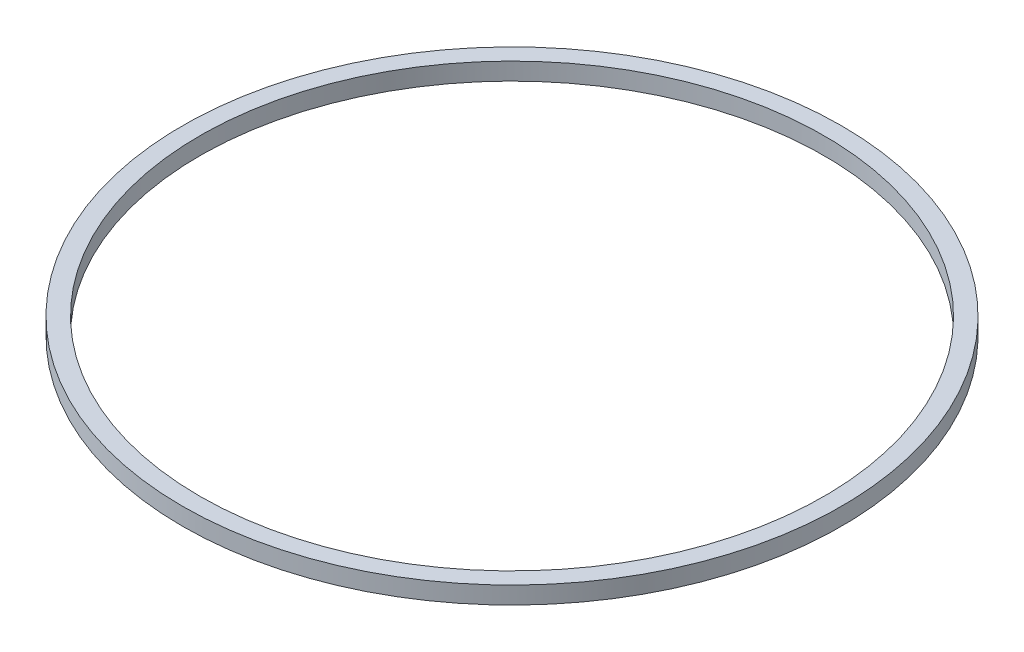
ISO-10303-21;
HEADER;
FILE_DESCRIPTION(('STEP AP214'),'2;1');
FILE_NAME('part.step','',(''),(''),'','','');
FILE_SCHEMA(('AUTOMOTIVE_DESIGN { 1 0 10303 214 1 1 1 1 }'));
ENDSEC;
DATA;
#1=APPLICATION_CONTEXT('core data for automotive mechanical design processes');
#2=APPLICATION_PROTOCOL_DEFINITION('international standard','automotive_design',2000,#1);
#3=PRODUCT_CONTEXT('',#1,'mechanical');
#4=PRODUCT('Part','Part','',(#3));
#5=PRODUCT_RELATED_PRODUCT_CATEGORY('part','',(#4));
#6=PRODUCT_DEFINITION_FORMATION('','',#4);
#7=PRODUCT_DEFINITION_CONTEXT('part definition',#1,'design');
#8=PRODUCT_DEFINITION('design','',#6,#7);
#9=PRODUCT_DEFINITION_SHAPE('','',#8);
#10=(LENGTH_UNIT() NAMED_UNIT(*) SI_UNIT(.MILLI.,.METRE.));
#11=(NAMED_UNIT(*) PLANE_ANGLE_UNIT() SI_UNIT($,.RADIAN.));
#12=(NAMED_UNIT(*) SI_UNIT($,.STERADIAN.) SOLID_ANGLE_UNIT());
#13=UNCERTAINTY_MEASURE_WITH_UNIT(LENGTH_MEASURE(1.E-05),#10,'distance_accuracy_value','');
#14=(GEOMETRIC_REPRESENTATION_CONTEXT(3) GLOBAL_UNCERTAINTY_ASSIGNED_CONTEXT((#13)) GLOBAL_UNIT_ASSIGNED_CONTEXT((#10,
#11,#12)) REPRESENTATION_CONTEXT('',''));
#15=CARTESIAN_POINT('',(0.,0.,0.));
#16=DIRECTION('',(0.,0.,1.));
#17=DIRECTION('',(1.,0.,0.));
#18=AXIS2_PLACEMENT_3D('',#15,#16,#17);
#19=CARTESIAN_POINT('',(0.,3.,0.));
#20=DIRECTION('',(0.,1.,0.));
#21=DIRECTION('',(0.,0.,1.));
#22=AXIS2_PLACEMENT_3D('',#19,#20,#21);
#23=PLANE('',#22);
#24=CARTESIAN_POINT('',(0.,3.,0.));
#25=DIRECTION('',(0.,1.,0.));
#26=DIRECTION('',(0.,0.,1.));
#27=AXIS2_PLACEMENT_3D('',#24,#25,#26);
#28=CIRCLE('',#27,57.);
#29=CARTESIAN_POINT('',(0.,3.,57.));
#30=VERTEX_POINT('',#29);
#31=EDGE_CURVE('E10',#30,#30,#28,.T.);
#32=ORIENTED_EDGE('',*,*,#31,.T.);
#33=EDGE_LOOP('',(#32));
#34=FACE_BOUND('',#33,.T.);
#35=CARTESIAN_POINT('',(0.,3.,0.));
#36=DIRECTION('',(0.,1.,0.));
#37=DIRECTION('',(0.,0.,1.));
#38=AXIS2_PLACEMENT_3D('',#35,#36,#37);
#39=CIRCLE('',#38,54.);
#40=CARTESIAN_POINT('',(0.,3.,54.));
#41=VERTEX_POINT('',#40);
#42=EDGE_CURVE('E54',#41,#41,#39,.T.);
#43=ORIENTED_EDGE('',*,*,#42,.F.);
#44=EDGE_LOOP('',(#43));
#45=FACE_BOUND('',#44,.T.);
#46=ADVANCED_FACE('F41',(#34,#45),#23,.T.);
#47=CARTESIAN_POINT('',(0.,0.,0.));
#48=DIRECTION('',(0.,1.,0.));
#49=DIRECTION('',(0.,0.,1.));
#50=AXIS2_PLACEMENT_3D('',#47,#48,#49);
#51=PLANE('',#50);
#52=CARTESIAN_POINT('',(0.,0.,0.));
#53=DIRECTION('',(0.,1.,0.));
#54=DIRECTION('',(0.,0.,1.));
#55=AXIS2_PLACEMENT_3D('',#52,#53,#54);
#56=CIRCLE('',#55,57.);
#57=CARTESIAN_POINT('',(0.,0.,57.));
#58=VERTEX_POINT('',#57);
#59=EDGE_CURVE('E45',#58,#58,#56,.T.);
#60=ORIENTED_EDGE('',*,*,#59,.F.);
#61=EDGE_LOOP('',(#60));
#62=FACE_BOUND('',#61,.T.);
#63=CARTESIAN_POINT('',(0.,0.,0.));
#64=DIRECTION('',(0.,1.,0.));
#65=DIRECTION('',(0.,0.,1.));
#66=AXIS2_PLACEMENT_3D('',#63,#64,#65);
#67=CIRCLE('',#66,54.);
#68=CARTESIAN_POINT('',(0.,0.,54.));
#69=VERTEX_POINT('',#68);
#70=EDGE_CURVE('E56',#69,#69,#67,.T.);
#71=ORIENTED_EDGE('',*,*,#70,.T.);
#72=EDGE_LOOP('',(#71));
#73=FACE_BOUND('',#72,.T.);
#74=ADVANCED_FACE('F68',(#62,#73),#51,.F.);
#75=CARTESIAN_POINT('',(0.,3.,0.));
#76=DIRECTION('',(0.,-1.,0.));
#77=DIRECTION('',(0.,0.,-1.));
#78=AXIS2_PLACEMENT_3D('',#75,#76,#77);
#79=CYLINDRICAL_SURFACE('',#78,57.);
#80=ORIENTED_EDGE('',*,*,#31,.F.);
#81=EDGE_LOOP('',(#80));
#82=FACE_BOUND('',#81,.T.);
#83=ORIENTED_EDGE('',*,*,#59,.T.);
#84=EDGE_LOOP('',(#83));
#85=FACE_BOUND('',#84,.T.);
#86=ADVANCED_FACE('F43',(#82,#85),#79,.T.);
#87=CARTESIAN_POINT('',(0.,3.,0.));
#88=DIRECTION('',(0.,-1.,0.));
#89=DIRECTION('',(0.,0.,-1.));
#90=AXIS2_PLACEMENT_3D('',#87,#88,#89);
#91=CYLINDRICAL_SURFACE('',#90,54.);
#92=ORIENTED_EDGE('',*,*,#42,.T.);
#93=EDGE_LOOP('',(#92));
#94=FACE_BOUND('',#93,.T.);
#95=ORIENTED_EDGE('',*,*,#70,.F.);
#96=EDGE_LOOP('',(#95));
#97=FACE_BOUND('',#96,.T.);
#98=ADVANCED_FACE('F64',(#94,#97),#91,.F.);
#99=CLOSED_SHELL('',(#46,#74,#86,#98));
#100=MANIFOLD_SOLID_BREP('B2',#99);
#101=ADVANCED_BREP_SHAPE_REPRESENTATION('',(#18,#100),#14);
#102=SHAPE_DEFINITION_REPRESENTATION(#9,#101);
ENDSEC;
END-ISO-10303-21;
